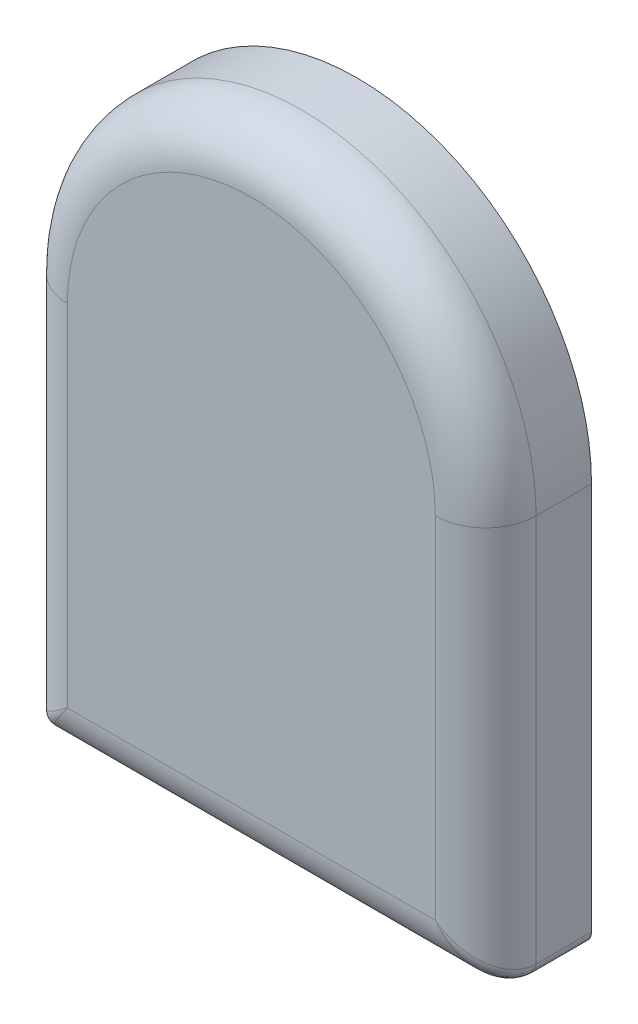
ISO-10303-21;
HEADER;
FILE_DESCRIPTION(('STEP AP214'),'2;1');
FILE_NAME('part.step','',(''),(''),'','','');
FILE_SCHEMA(('AUTOMOTIVE_DESIGN { 1 0 10303 214 1 1 1 1 }'));
ENDSEC;
DATA;
#1=APPLICATION_CONTEXT('core data for automotive mechanical design processes');
#2=APPLICATION_PROTOCOL_DEFINITION('international standard','automotive_design',2000,#1);
#3=PRODUCT_CONTEXT('',#1,'mechanical');
#4=PRODUCT('Part','Part','',(#3));
#5=PRODUCT_RELATED_PRODUCT_CATEGORY('part','',(#4));
#6=PRODUCT_DEFINITION_FORMATION('','',#4);
#7=PRODUCT_DEFINITION_CONTEXT('part definition',#1,'design');
#8=PRODUCT_DEFINITION('design','',#6,#7);
#9=PRODUCT_DEFINITION_SHAPE('','',#8);
#10=(LENGTH_UNIT() NAMED_UNIT(*) SI_UNIT(.MILLI.,.METRE.));
#11=(NAMED_UNIT(*) PLANE_ANGLE_UNIT() SI_UNIT($,.RADIAN.));
#12=(NAMED_UNIT(*) SI_UNIT($,.STERADIAN.) SOLID_ANGLE_UNIT());
#13=UNCERTAINTY_MEASURE_WITH_UNIT(LENGTH_MEASURE(1.E-05),#10,'distance_accuracy_value','');
#14=(GEOMETRIC_REPRESENTATION_CONTEXT(3) GLOBAL_UNCERTAINTY_ASSIGNED_CONTEXT((#13)) GLOBAL_UNIT_ASSIGNED_CONTEXT((#10,
#11,#12)) REPRESENTATION_CONTEXT('',''));
#15=CARTESIAN_POINT('',(0.,0.,0.));
#16=DIRECTION('',(0.,0.,1.));
#17=DIRECTION('',(1.,0.,0.));
#18=AXIS2_PLACEMENT_3D('',#15,#16,#17);
#19=CARTESIAN_POINT('',(8.8,-12.1,4.2));
#20=DIRECTION('',(0.,0.,-1.));
#21=DIRECTION('',(-1.,0.,0.));
#22=AXIS2_PLACEMENT_3D('',#19,#20,#21);
#23=CYLINDRICAL_SURFACE('',#22,0.5);
#24=DIRECTION('',(0.,0.,-1.));
#25=VECTOR('',#24,1.);
#26=CARTESIAN_POINT('',(9.3,-12.1,4.2));
#27=LINE('',#26,#25);
#28=CARTESIAN_POINT('',(9.3,-12.1,2.2));
#29=VERTEX_POINT('',#28);
#30=CARTESIAN_POINT('',(9.3,-12.1,0.));
#31=VERTEX_POINT('',#30);
#32=EDGE_CURVE('E103',#29,#31,#27,.T.);
#33=ORIENTED_EDGE('',*,*,#32,.F.);
#34=CARTESIAN_POINT('',(8.8,-12.1,2.2));
#35=DIRECTION('',(0.,0.,-1.));
#36=DIRECTION('',(-1.,0.,0.));
#37=AXIS2_PLACEMENT_3D('',#34,#35,#36);
#38=CIRCLE('',#37,0.5);
#39=CARTESIAN_POINT('',(8.8,-12.6,2.2));
#40=VERTEX_POINT('',#39);
#41=EDGE_CURVE('E161',#29,#40,#38,.T.);
#42=ORIENTED_EDGE('',*,*,#41,.T.);
#43=DIRECTION('',(0.,0.,-1.));
#44=VECTOR('',#43,1.);
#45=CARTESIAN_POINT('',(8.8,-12.6,4.2));
#46=LINE('',#45,#44);
#47=CARTESIAN_POINT('',(8.8,-12.6,0.));
#48=VERTEX_POINT('',#47);
#49=EDGE_CURVE('E127',#40,#48,#46,.T.);
#50=ORIENTED_EDGE('',*,*,#49,.T.);
#51=CARTESIAN_POINT('',(8.8,-12.1,0.));
#52=DIRECTION('',(0.,0.,1.));
#53=DIRECTION('',(1.,0.,0.));
#54=AXIS2_PLACEMENT_3D('',#51,#52,#53);
#55=CIRCLE('',#54,0.5);
#56=EDGE_CURVE('E121',#48,#31,#55,.T.);
#57=ORIENTED_EDGE('',*,*,#56,.T.);
#58=EDGE_LOOP('',(#33,#42,#50,#57));
#59=FACE_BOUND('',#58,.T.);
#60=ADVANCED_FACE('F38',(#59),#23,.T.);
#61=CARTESIAN_POINT('',(9.3,3.3,4.2));
#62=DIRECTION('',(-1.,0.,0.));
#63=DIRECTION('',(0.,0.,1.));
#64=AXIS2_PLACEMENT_3D('',#61,#62,#63);
#65=PLANE('',#64);
#66=DIRECTION('',(0.,0.,-1.));
#67=VECTOR('',#66,1.);
#68=CARTESIAN_POINT('',(9.3,3.3,4.2));
#69=LINE('',#68,#67);
#70=CARTESIAN_POINT('',(9.3,3.3,2.2));
#71=VERTEX_POINT('',#70);
#72=CARTESIAN_POINT('',(9.3,3.3,0.));
#73=VERTEX_POINT('',#72);
#74=EDGE_CURVE('E115',#71,#73,#69,.T.);
#75=ORIENTED_EDGE('',*,*,#74,.F.);
#76=DIRECTION('',(0.,1.,0.));
#77=VECTOR('',#76,1.);
#78=CARTESIAN_POINT('',(9.3,-12.1,2.2));
#79=LINE('',#78,#77);
#80=EDGE_CURVE('E110',#71,#29,#79,.F.);
#81=ORIENTED_EDGE('',*,*,#80,.T.);
#82=ORIENTED_EDGE('',*,*,#32,.T.);
#83=DIRECTION('',(0.,1.,0.));
#84=VECTOR('',#83,1.);
#85=CARTESIAN_POINT('',(9.3,3.3,0.));
#86=LINE('',#85,#84);
#87=EDGE_CURVE('E107',#31,#73,#86,.T.);
#88=ORIENTED_EDGE('',*,*,#87,.T.);
#89=EDGE_LOOP('',(#75,#81,#82,#88));
#90=FACE_BOUND('',#89,.T.);
#91=ADVANCED_FACE('F106',(#90),#65,.F.);
#92=CARTESIAN_POINT('',(0.,3.3,4.2));
#93=DIRECTION('',(0.,0.,-1.));
#94=DIRECTION('',(-1.,0.,0.));
#95=AXIS2_PLACEMENT_3D('',#92,#93,#94);
#96=CYLINDRICAL_SURFACE('',#95,9.3);
#97=DIRECTION('',(0.,0.,-1.));
#98=VECTOR('',#97,1.);
#99=CARTESIAN_POINT('',(-9.3,3.3,4.2));
#100=LINE('',#99,#98);
#101=CARTESIAN_POINT('',(-9.3,3.3,2.2));
#102=VERTEX_POINT('',#101);
#103=CARTESIAN_POINT('',(-9.3,3.3,0.));
#104=VERTEX_POINT('',#103);
#105=EDGE_CURVE('E147',#102,#104,#100,.T.);
#106=ORIENTED_EDGE('',*,*,#105,.F.);
#107=CARTESIAN_POINT('',(0.,3.3,2.2));
#108=DIRECTION('',(0.,0.,1.));
#109=DIRECTION('',(1.,0.,0.));
#110=AXIS2_PLACEMENT_3D('',#107,#108,#109);
#111=CIRCLE('',#110,9.3);
#112=EDGE_CURVE('E164',#102,#71,#111,.F.);
#113=ORIENTED_EDGE('',*,*,#112,.T.);
#114=ORIENTED_EDGE('',*,*,#74,.T.);
#115=CARTESIAN_POINT('',(0.,3.3,0.));
#116=DIRECTION('',(0.,0.,1.));
#117=DIRECTION('',(1.,0.,0.));
#118=AXIS2_PLACEMENT_3D('',#115,#116,#117);
#119=CIRCLE('',#118,9.3);
#120=EDGE_CURVE('E124',#73,#104,#119,.T.);
#121=ORIENTED_EDGE('',*,*,#120,.T.);
#122=EDGE_LOOP('',(#106,#113,#114,#121));
#123=FACE_BOUND('',#122,.T.);
#124=ADVANCED_FACE('F216',(#123),#96,.T.);
#125=CARTESIAN_POINT('',(-9.3,-12.1,4.2));
#126=DIRECTION('',(1.,0.,0.));
#127=DIRECTION('',(0.,1.,0.));
#128=AXIS2_PLACEMENT_3D('',#125,#126,#127);
#129=PLANE('',#128);
#130=DIRECTION('',(0.,0.,-1.));
#131=VECTOR('',#130,1.);
#132=CARTESIAN_POINT('',(-9.3,-12.1,4.2));
#133=LINE('',#132,#131);
#134=CARTESIAN_POINT('',(-9.3,-12.1,2.2));
#135=VERTEX_POINT('',#134);
#136=CARTESIAN_POINT('',(-9.3,-12.1,0.));
#137=VERTEX_POINT('',#136);
#138=EDGE_CURVE('E145',#135,#137,#133,.T.);
#139=ORIENTED_EDGE('',*,*,#138,.F.);
#140=DIRECTION('',(0.,-1.,0.));
#141=VECTOR('',#140,1.);
#142=CARTESIAN_POINT('',(-9.3,3.3,2.2));
#143=LINE('',#142,#141);
#144=EDGE_CURVE('E47',#135,#102,#143,.F.);
#145=ORIENTED_EDGE('',*,*,#144,.T.);
#146=ORIENTED_EDGE('',*,*,#105,.T.);
#147=DIRECTION('',(0.,-1.,0.));
#148=VECTOR('',#147,1.);
#149=CARTESIAN_POINT('',(-9.3,-12.1,0.));
#150=LINE('',#149,#148);
#151=EDGE_CURVE('E134',#104,#137,#150,.T.);
#152=ORIENTED_EDGE('',*,*,#151,.T.);
#153=EDGE_LOOP('',(#139,#145,#146,#152));
#154=FACE_BOUND('',#153,.T.);
#155=ADVANCED_FACE('F217',(#154),#129,.F.);
#156=CARTESIAN_POINT('',(-8.8,-12.1,4.2));
#157=DIRECTION('',(0.,0.,-1.));
#158=DIRECTION('',(-1.,0.,0.));
#159=AXIS2_PLACEMENT_3D('',#156,#157,#158);
#160=CYLINDRICAL_SURFACE('',#159,0.5);
#161=DIRECTION('',(0.,0.,-1.));
#162=VECTOR('',#161,1.);
#163=CARTESIAN_POINT('',(-8.8,-12.6,4.2));
#164=LINE('',#163,#162);
#165=CARTESIAN_POINT('',(-8.8,-12.6,2.2));
#166=VERTEX_POINT('',#165);
#167=CARTESIAN_POINT('',(-8.8,-12.6,0.));
#168=VERTEX_POINT('',#167);
#169=EDGE_CURVE('E143',#166,#168,#164,.T.);
#170=ORIENTED_EDGE('',*,*,#169,.F.);
#171=CARTESIAN_POINT('',(-8.8,-12.1,2.2));
#172=DIRECTION('',(0.,0.,-1.));
#173=DIRECTION('',(-1.,0.,0.));
#174=AXIS2_PLACEMENT_3D('',#171,#172,#173);
#175=CIRCLE('',#174,0.5);
#176=EDGE_CURVE('E11',#166,#135,#175,.T.);
#177=ORIENTED_EDGE('',*,*,#176,.T.);
#178=ORIENTED_EDGE('',*,*,#138,.T.);
#179=CARTESIAN_POINT('',(-8.8,-12.1,0.));
#180=DIRECTION('',(0.,0.,1.));
#181=DIRECTION('',(1.,0.,0.));
#182=AXIS2_PLACEMENT_3D('',#179,#180,#181);
#183=CIRCLE('',#182,0.5);
#184=EDGE_CURVE('E137',#137,#168,#183,.T.);
#185=ORIENTED_EDGE('',*,*,#184,.T.);
#186=EDGE_LOOP('',(#170,#177,#178,#185));
#187=FACE_BOUND('',#186,.T.);
#188=ADVANCED_FACE('F219',(#187),#160,.T.);
#189=CARTESIAN_POINT('',(8.8,-12.6,4.2));
#190=DIRECTION('',(0.,1.,0.));
#191=DIRECTION('',(0.,0.,1.));
#192=AXIS2_PLACEMENT_3D('',#189,#190,#191);
#193=PLANE('',#192);
#194=ORIENTED_EDGE('',*,*,#49,.F.);
#195=DIRECTION('',(1.,0.,0.));
#196=VECTOR('',#195,1.);
#197=CARTESIAN_POINT('',(-8.8,-12.6,2.2));
#198=LINE('',#197,#196);
#199=EDGE_CURVE('E158',#40,#166,#198,.F.);
#200=ORIENTED_EDGE('',*,*,#199,.T.);
#201=ORIENTED_EDGE('',*,*,#169,.T.);
#202=DIRECTION('',(1.,0.,0.));
#203=VECTOR('',#202,1.);
#204=CARTESIAN_POINT('',(8.8,-12.6,0.));
#205=LINE('',#204,#203);
#206=EDGE_CURVE('E140',#168,#48,#205,.T.);
#207=ORIENTED_EDGE('',*,*,#206,.T.);
#208=EDGE_LOOP('',(#194,#200,#201,#207));
#209=FACE_BOUND('',#208,.T.);
#210=ADVANCED_FACE('F221',(#209),#193,.F.);
#211=CARTESIAN_POINT('',(8.8,-12.1,4.2));
#212=DIRECTION('',(0.,0.,1.));
#213=DIRECTION('',(1.,0.,0.));
#214=AXIS2_PLACEMENT_3D('',#211,#212,#213);
#215=PLANE('',#214);
#216=DIRECTION('',(0.,-1.,0.));
#217=VECTOR('',#216,1.);
#218=CARTESIAN_POINT('',(-7.3,-12.1,4.2));
#219=LINE('',#218,#217);
#220=CARTESIAN_POINT('',(-7.3,3.3,4.2));
#221=VERTEX_POINT('',#220);
#222=CARTESIAN_POINT('',(-7.3,-10.6,4.2));
#223=VERTEX_POINT('',#222);
#224=EDGE_CURVE('E114',#221,#223,#219,.T.);
#225=ORIENTED_EDGE('',*,*,#224,.T.);
#226=DIRECTION('',(1.,0.,0.));
#227=VECTOR('',#226,1.);
#228=CARTESIAN_POINT('',(8.8,-10.6,4.2));
#229=LINE('',#228,#227);
#230=CARTESIAN_POINT('',(7.3,-10.6,4.2));
#231=VERTEX_POINT('',#230);
#232=EDGE_CURVE('E155',#223,#231,#229,.T.);
#233=ORIENTED_EDGE('',*,*,#232,.T.);
#234=DIRECTION('',(0.,1.,0.));
#235=VECTOR('',#234,1.);
#236=CARTESIAN_POINT('',(7.3,3.3,4.2));
#237=LINE('',#236,#235);
#238=CARTESIAN_POINT('',(7.3,3.3,4.2));
#239=VERTEX_POINT('',#238);
#240=EDGE_CURVE('E153',#231,#239,#237,.T.);
#241=ORIENTED_EDGE('',*,*,#240,.T.);
#242=CARTESIAN_POINT('',(0.,3.3,4.2));
#243=DIRECTION('',(0.,0.,1.));
#244=DIRECTION('',(1.,0.,0.));
#245=AXIS2_PLACEMENT_3D('',#242,#243,#244);
#246=CIRCLE('',#245,7.3);
#247=EDGE_CURVE('E151',#239,#221,#246,.T.);
#248=ORIENTED_EDGE('',*,*,#247,.T.);
#249=EDGE_LOOP('',(#225,#233,#241,#248));
#250=FACE_BOUND('',#249,.T.);
#251=ADVANCED_FACE('F227',(#250),#215,.T.);
#252=CARTESIAN_POINT('',(8.8,-12.1,0.));
#253=DIRECTION('',(0.,0.,1.));
#254=DIRECTION('',(1.,0.,0.));
#255=AXIS2_PLACEMENT_3D('',#252,#253,#254);
#256=PLANE('',#255);
#257=ORIENTED_EDGE('',*,*,#56,.F.);
#258=ORIENTED_EDGE('',*,*,#206,.F.);
#259=ORIENTED_EDGE('',*,*,#184,.F.);
#260=ORIENTED_EDGE('',*,*,#151,.F.);
#261=ORIENTED_EDGE('',*,*,#120,.F.);
#262=ORIENTED_EDGE('',*,*,#87,.F.);
#263=EDGE_LOOP('',(#257,#258,#259,#260,#261,#262));
#264=FACE_BOUND('',#263,.T.);
#265=ADVANCED_FACE('F119',(#264),#256,.F.);
#266=CARTESIAN_POINT('',(0.,3.3,2.2));
#267=DIRECTION('',(0.,0.,1.));
#268=DIRECTION('',(1.,0.,0.));
#269=AXIS2_PLACEMENT_3D('',#266,#267,#268);
#270=TOROIDAL_SURFACE('',#269,7.3,2.);
#271=CARTESIAN_POINT('',(7.3,3.3,2.2));
#272=DIRECTION('',(0.,-1.,0.));
#273=DIRECTION('',(0.,0.,-1.));
#274=AXIS2_PLACEMENT_3D('',#271,#272,#273);
#275=CIRCLE('',#274,2.);
#276=EDGE_CURVE('E131',#71,#239,#275,.T.);
#277=ORIENTED_EDGE('',*,*,#276,.F.);
#278=ORIENTED_EDGE('',*,*,#112,.F.);
#279=CARTESIAN_POINT('',(-7.3,3.3,2.2));
#280=DIRECTION('',(0.,-1.,0.));
#281=DIRECTION('',(1.,0.,0.));
#282=AXIS2_PLACEMENT_3D('',#279,#280,#281);
#283=CIRCLE('',#282,2.);
#284=EDGE_CURVE('E42',#221,#102,#283,.T.);
#285=ORIENTED_EDGE('',*,*,#284,.F.);
#286=ORIENTED_EDGE('',*,*,#247,.F.);
#287=EDGE_LOOP('',(#277,#278,#285,#286));
#288=FACE_BOUND('',#287,.T.);
#289=ADVANCED_FACE('F40',(#288),#270,.T.);
#290=CARTESIAN_POINT('',(-7.3,-12.1,2.2));
#291=DIRECTION('',(0.,1.,0.));
#292=DIRECTION('',(-1.,0.,0.));
#293=AXIS2_PLACEMENT_3D('',#290,#291,#292);
#294=CYLINDRICAL_SURFACE('',#293,2.);
#295=ORIENTED_EDGE('',*,*,#284,.T.);
#296=ORIENTED_EDGE('',*,*,#144,.F.);
#297=CARTESIAN_POINT('',(-7.3,-10.6,2.2));
#298=DIRECTION('',(0.6,-0.8,0.));
#299=DIRECTION('',(-0.8,-0.6,0.));
#300=AXIS2_PLACEMENT_3D('',#297,#298,#299);
#301=ELLIPSE('',#300,2.5,2.);
#302=EDGE_CURVE('E174',#223,#135,#301,.T.);
#303=ORIENTED_EDGE('',*,*,#302,.F.);
#304=ORIENTED_EDGE('',*,*,#224,.F.);
#305=EDGE_LOOP('',(#295,#296,#303,#304));
#306=FACE_BOUND('',#305,.T.);
#307=ADVANCED_FACE('F194',(#306),#294,.T.);
#308=CARTESIAN_POINT('',(7.3,-12.1,2.2));
#309=DIRECTION('',(0.,-1.,0.));
#310=DIRECTION('',(0.,0.,-1.));
#311=AXIS2_PLACEMENT_3D('',#308,#309,#310);
#312=CYLINDRICAL_SURFACE('',#311,2.);
#313=ORIENTED_EDGE('',*,*,#276,.T.);
#314=ORIENTED_EDGE('',*,*,#240,.F.);
#315=CARTESIAN_POINT('',(7.3,-10.6,2.2));
#316=DIRECTION('',(0.6,0.8,0.));
#317=DIRECTION('',(0.8,-0.6,0.));
#318=AXIS2_PLACEMENT_3D('',#315,#316,#317);
#319=ELLIPSE('',#318,2.5,2.);
#320=EDGE_CURVE('E171',#29,#231,#319,.F.);
#321=ORIENTED_EDGE('',*,*,#320,.F.);
#322=ORIENTED_EDGE('',*,*,#80,.F.);
#323=EDGE_LOOP('',(#313,#314,#321,#322));
#324=FACE_BOUND('',#323,.T.);
#325=ADVANCED_FACE('F190',(#324),#312,.T.);
#326=CARTESIAN_POINT('',(-7.3,-10.6,0.200000000000001));
#327=CARTESIAN_POINT('',(-7.3,-10.6,0.200000000000001));
#328=CARTESIAN_POINT('',(-7.3,-10.6,0.200000000000001));
#329=CARTESIAN_POINT('',(-7.36534712065569,-10.6871294942076,0.200035055250015));
#330=CARTESIAN_POINT('',(-7.37625301968526,-10.6762530196853,0.199976339095898));
#331=CARTESIAN_POINT('',(-7.38712949420759,-10.6653471206557,0.200035055250015));
#332=CARTESIAN_POINT('',(-7.43071092668624,-10.7742812355817,0.205696487430835));
#333=CARTESIAN_POINT('',(-7.45271669848803,-10.752716698488,0.204277360821934));
#334=CARTESIAN_POINT('',(-7.47428123558166,-10.7307109266862,0.205696487430835));
#335=CARTESIAN_POINT('',(-7.56031449090428,-10.9470859878724,0.228427051088899));
#336=CARTESIAN_POINT('',(-7.60446975212246,-10.9044697521225,0.22140059823371));
#337=CARTESIAN_POINT('',(-7.64708598787237,-10.8603144909043,0.228427051088899));
#338=CARTESIAN_POINT('',(-7.62455908096206,-11.0327454412827,0.245398809321809));
#339=CARTESIAN_POINT('',(-7.68019165762918,-10.9801916576292,0.234247025705178));
#340=CARTESIAN_POINT('',(-7.73274544128274,-10.9245590809621,0.245398809321809));
#341=CARTESIAN_POINT('',(-7.75083012894728,-11.2011068385964,0.290516308556291));
#342=CARTESIAN_POINT('',(-7.82973753195478,-11.1297375319548,0.268479521630331));
#343=CARTESIAN_POINT('',(-7.90110683859638,-11.0508301289473,0.290516308556291));
#344=CARTESIAN_POINT('',(-7.81287571744484,-11.2838342899265,0.318469854155509));
#345=CARTESIAN_POINT('',(-7.90398851452828,-11.2039885145283,0.289912895749702));
#346=CARTESIAN_POINT('',(-7.98383428992645,-11.1128757174448,0.318469854155509));
#347=CARTESIAN_POINT('',(-7.93366820048003,-11.4448909339734,0.385180085693134));
#348=CARTESIAN_POINT('',(-8.04991425185414,-11.3499142518541,0.341360606992456));
#349=CARTESIAN_POINT('',(-8.14489093397337,-11.23366820048,0.385180085693134));
#350=CARTESIAN_POINT('',(-7.99245870376998,-11.5232782716933,0.423653679114348));
#351=CARTESIAN_POINT('',(-8.12200143121126,-11.4220014312113,0.371441966476322));
#352=CARTESIAN_POINT('',(-8.22327827169331,-11.29245870377,0.423653679114348));
#353=CARTESIAN_POINT('',(-8.10570975300993,-11.6742796706799,0.510834776663723));
#354=CARTESIAN_POINT('',(-8.26295325731846,-11.5629532573185,0.440367062406523));
#355=CARTESIAN_POINT('',(-8.3742796706799,-11.4057097530099,0.510834776663724));
#356=CARTESIAN_POINT('',(-8.1602485580067,-11.7469980773423,0.559177555106217));
#357=CARTESIAN_POINT('',(-8.33220337416109,-11.6322033741611,0.479288917524901));
#358=CARTESIAN_POINT('',(-8.44699807734226,-11.4602485580067,0.559177555106218));
#359=CARTESIAN_POINT('',(-8.26402611496821,-11.8853681532909,0.665353034789945));
#360=CARTESIAN_POINT('',(-8.46682192510474,-11.7668219251047,0.566297856684954));
#361=CARTESIAN_POINT('',(-8.58536815329094,-11.5640261149682,0.665353034789946));
#362=CARTESIAN_POINT('',(-8.31338750743845,-11.9511833432513,0.722755397155792));
#363=CARTESIAN_POINT('',(-8.53252990498461,-11.8325299049846,0.614455680376174));
#364=CARTESIAN_POINT('',(-8.65118334325127,-11.6133875074385,0.722755397155792));
#365=CARTESIAN_POINT('',(-8.40591892041319,-12.0745585605509,0.846132222162794));
#366=CARTESIAN_POINT('',(-8.65927843911775,-11.9592784391177,0.72064706325371));
#367=CARTESIAN_POINT('',(-8.77455856055092,-11.7059189204132,0.846132222162793));
#368=CARTESIAN_POINT('',(-8.44926311849199,-12.132350824656,0.911637313282867));
#369=CARTESIAN_POINT('',(-8.72058796060971,-12.0205879606097,0.77870927589382));
#370=CARTESIAN_POINT('',(-8.83235082465598,-11.749263118492,0.911637313282867));
#371=CARTESIAN_POINT('',(-8.52896450999682,-12.2386193466624,1.05013285836796));
#372=CARTESIAN_POINT('',(-8.83742230607737,-12.1374223060774,0.905718655842486));
#373=CARTESIAN_POINT('',(-8.93861934666242,-11.8289645099968,1.05013285836796));
#374=CARTESIAN_POINT('',(-8.56554818620167,-12.2873975816022,1.12265451812362));
#375=CARTESIAN_POINT('',(-8.893119014594,-12.193119014594,0.974594782404193));
#376=CARTESIAN_POINT('',(-8.98739758160222,-11.8655481862017,1.12265451812362));
#377=CARTESIAN_POINT('',(-8.63104897214961,-12.3747319628661,1.27392958631864));
#378=CARTESIAN_POINT('',(-8.99700237456934,-12.2970023745693,1.12428825163707));
#379=CARTESIAN_POINT('',(-9.07473196286614,-11.9310489721496,1.27392958631864));
#380=CARTESIAN_POINT('',(-8.66023331373321,-12.4136444183109,1.35226632370846));
#381=CARTESIAN_POINT('',(-9.04524564728287,-12.3452456472829,1.20485256451251));
#382=CARTESIAN_POINT('',(-9.11364441831094,-11.9602333137332,1.35226632370846));
#383=CARTESIAN_POINT('',(-8.71039789563343,-12.4805305275112,1.51375694675793));
#384=CARTESIAN_POINT('',(-9.13168487740083,-12.4316848774008,1.37835057694996));
#385=CARTESIAN_POINT('',(-9.18053052751125,-12.0103978956334,1.51375694675793));
#386=CARTESIAN_POINT('',(-8.73165591145982,-12.5088745486131,1.59659973042092));
#387=CARTESIAN_POINT('',(-9.16982930810949,-12.4698293081095,1.47075659896622));
#388=CARTESIAN_POINT('',(-9.20887454861309,-12.0316559114598,1.59659973042092));
#389=CARTESIAN_POINT('',(-8.76560412617006,-12.5541388348934,1.76554895244281));
#390=CARTESIAN_POINT('',(-9.23291592445389,-12.5329159244539,1.6666663568643));
#391=CARTESIAN_POINT('',(-9.25413883489341,-12.0656041261701,1.76554895244281));
#392=CARTESIAN_POINT('',(-8.7785324204649,-12.5713765606199,1.85148270452044));
#393=CARTESIAN_POINT('',(-9.25774658379329,-12.5577465837933,1.76930869505542));
#394=CARTESIAN_POINT('',(-9.27137656061987,-12.0785324204649,1.85148270452044));
#395=CARTESIAN_POINT('',(-8.79566049473916,-12.5942139929855,2.0249775244552));
#396=CARTESIAN_POINT('',(-9.29133353940984,-12.5913335394098,1.98185786072974));
#397=CARTESIAN_POINT('',(-9.29421399298555,-12.0956604947392,2.0249775244552));
#398=CARTESIAN_POINT('',(-8.8,-12.6,2.1124887622276));
#399=CARTESIAN_POINT('',(-9.3,-12.6,2.0906106505444));
#400=CARTESIAN_POINT('',(-9.3,-12.1,2.1124887622276));
#401=CARTESIAN_POINT('',(-8.8,-12.6,2.2875112377724));
#402=CARTESIAN_POINT('',(-9.3,-12.6,2.30938934945561));
#403=CARTESIAN_POINT('',(-9.3,-12.1,2.2875112377724));
#404=CARTESIAN_POINT('',(-8.79566049473916,-12.5942139929855,2.37502247554481));
#405=CARTESIAN_POINT('',(-9.29133353940984,-12.5913335394098,2.41814213927026));
#406=CARTESIAN_POINT('',(-9.29421399298555,-12.0956604947392,2.37502247554481));
#407=CARTESIAN_POINT('',(-8.7785324204649,-12.5713765606199,2.54851729547956));
#408=CARTESIAN_POINT('',(-9.25774658379329,-12.5577465837933,2.63069130494458));
#409=CARTESIAN_POINT('',(-9.27137656061987,-12.0785324204649,2.54851729547956));
#410=CARTESIAN_POINT('',(-8.76560412617006,-12.5541388348934,2.63445104755719));
#411=CARTESIAN_POINT('',(-9.23291592445389,-12.5329159244539,2.7333336431357));
#412=CARTESIAN_POINT('',(-9.25413883489341,-12.0656041261701,2.63445104755719));
#413=CARTESIAN_POINT('',(-8.73165591145982,-12.5088745486131,2.80340026957908));
#414=CARTESIAN_POINT('',(-9.16982930810949,-12.4698293081095,2.92924340103378));
#415=CARTESIAN_POINT('',(-9.20887454861309,-12.0316559114598,2.80340026957908));
#416=CARTESIAN_POINT('',(-8.71039789563343,-12.4805305275113,2.88624305324207));
#417=CARTESIAN_POINT('',(-9.13168487740083,-12.4316848774008,3.02164942305004));
#418=CARTESIAN_POINT('',(-9.18053052751125,-12.0103978956334,2.88624305324207));
#419=CARTESIAN_POINT('',(-8.66023331373321,-12.4136444183109,3.04773367629154));
#420=CARTESIAN_POINT('',(-9.04524564728287,-12.3452456472829,3.19514743548749));
#421=CARTESIAN_POINT('',(-9.11364441831094,-11.9602333137332,3.04773367629154));
#422=CARTESIAN_POINT('',(-8.63104897214961,-12.3747319628661,3.12607041368136));
#423=CARTESIAN_POINT('',(-8.99700237456934,-12.2970023745693,3.27571174836293));
#424=CARTESIAN_POINT('',(-9.07473196286614,-11.9310489721496,3.12607041368136));
#425=CARTESIAN_POINT('',(-8.56554818620167,-12.2873975816022,3.27734548187638));
#426=CARTESIAN_POINT('',(-8.893119014594,-12.193119014594,3.42540521759581));
#427=CARTESIAN_POINT('',(-8.98739758160222,-11.8655481862017,3.27734548187638));
#428=CARTESIAN_POINT('',(-8.52896450999682,-12.2386193466624,3.34986714163205));
#429=CARTESIAN_POINT('',(-8.83742230607737,-12.1374223060774,3.49428134415751));
#430=CARTESIAN_POINT('',(-8.93861934666242,-11.8289645099968,3.34986714163205));
#431=CARTESIAN_POINT('',(-8.44926311849199,-12.132350824656,3.48836268671713));
#432=CARTESIAN_POINT('',(-8.72058796060971,-12.0205879606097,3.62129072410618));
#433=CARTESIAN_POINT('',(-8.83235082465598,-11.749263118492,3.48836268671713));
#434=CARTESIAN_POINT('',(-8.40591892041319,-12.0745585605509,3.55386777783721));
#435=CARTESIAN_POINT('',(-8.65927843911775,-11.9592784391177,3.67935293674629));
#436=CARTESIAN_POINT('',(-8.77455856055092,-11.7059189204132,3.55386777783721));
#437=CARTESIAN_POINT('',(-8.31338750743845,-11.9511833432513,3.67724460284421));
#438=CARTESIAN_POINT('',(-8.53252990498461,-11.8325299049846,3.78554431962383));
#439=CARTESIAN_POINT('',(-8.65118334325127,-11.6133875074385,3.67724460284421));
#440=CARTESIAN_POINT('',(-8.26402611496821,-11.8853681532909,3.73464696521006));
#441=CARTESIAN_POINT('',(-8.46682192510474,-11.7668219251047,3.83370214331505));
#442=CARTESIAN_POINT('',(-8.58536815329094,-11.5640261149682,3.73464696521006));
#443=CARTESIAN_POINT('',(-8.1602485580067,-11.7469980773423,3.84082244489378));
#444=CARTESIAN_POINT('',(-8.33220337416109,-11.6322033741611,3.9207110824751));
#445=CARTESIAN_POINT('',(-8.44699807734226,-11.4602485580067,3.84082244489378));
#446=CARTESIAN_POINT('',(-8.10570975300993,-11.6742796706799,3.88916522333628));
#447=CARTESIAN_POINT('',(-8.26295325731846,-11.5629532573185,3.95963293759348));
#448=CARTESIAN_POINT('',(-8.3742796706799,-11.4057097530099,3.88916522333628));
#449=CARTESIAN_POINT('',(-7.99245870376998,-11.5232782716933,3.97634632088565));
#450=CARTESIAN_POINT('',(-8.12200143121126,-11.4220014312113,4.02855803352368));
#451=CARTESIAN_POINT('',(-8.22327827169331,-11.29245870377,3.97634632088565));
#452=CARTESIAN_POINT('',(-7.93366820048003,-11.4448909339734,4.01481991430687));
#453=CARTESIAN_POINT('',(-8.04991425185414,-11.3499142518541,4.05863939300755));
#454=CARTESIAN_POINT('',(-8.14489093397337,-11.23366820048,4.01481991430687));
#455=CARTESIAN_POINT('',(-7.81287571744484,-11.2838342899265,4.08153014584449));
#456=CARTESIAN_POINT('',(-7.90398851452829,-11.2039885145283,4.1100871042503));
#457=CARTESIAN_POINT('',(-7.98383428992646,-11.1128757174448,4.08153014584449));
#458=CARTESIAN_POINT('',(-7.75083012894728,-11.2011068385964,4.10948369144371));
#459=CARTESIAN_POINT('',(-7.82973753195478,-11.1297375319548,4.13152047836967));
#460=CARTESIAN_POINT('',(-7.90110683859638,-11.0508301289473,4.10948369144371));
#461=CARTESIAN_POINT('',(-7.62455908096206,-11.0327454412827,4.15460119067819));
#462=CARTESIAN_POINT('',(-7.68019165762918,-10.9801916576292,4.16575297429482));
#463=CARTESIAN_POINT('',(-7.73274544128274,-10.9245590809621,4.15460119067819));
#464=CARTESIAN_POINT('',(-7.56031449090428,-10.9470859878724,4.1715729489111));
#465=CARTESIAN_POINT('',(-7.60446975212246,-10.9044697521225,4.17859940176629));
#466=CARTESIAN_POINT('',(-7.64708598787237,-10.8603144909043,4.1715729489111));
#467=CARTESIAN_POINT('',(-7.43071092668624,-10.7742812355817,4.19430351256917));
#468=CARTESIAN_POINT('',(-7.45271669848803,-10.752716698488,4.19572263917807));
#469=CARTESIAN_POINT('',(-7.47428123558166,-10.7307109266862,4.19430351256917));
#470=CARTESIAN_POINT('',(-7.3653471206557,-10.6871294942076,4.19996494474999));
#471=CARTESIAN_POINT('',(-7.37625301968526,-10.6762530196853,4.2000236609041));
#472=CARTESIAN_POINT('',(-7.38712949420759,-10.6653471206557,4.19996494474999));
#473=CARTESIAN_POINT('',(-7.3,-10.6,4.2));
#474=CARTESIAN_POINT('',(-7.3,-10.6,4.2));
#475=CARTESIAN_POINT('',(-7.3,-10.6,4.2));
#476=(BOUNDED_SURFACE() B_SPLINE_SURFACE(3,2,((#326,#327,#328),(#329,#330,#331),(#332,#333,
#334),(#335,#336,#337),(#338,#339,#340),(#341,#342,#343),(#344,#345,#346),(#347,#348,#349),
(#350,#351,#352),(#353,#354,#355),(#356,#357,#358),(#359,#360,#361),(#362,#363,#364),(#365,#366,
#367),(#368,#369,#370),(#371,#372,#373),(#374,#375,#376),(#377,#378,#379),(#380,#381,#382),
(#383,#384,#385),(#386,#387,#388),(#389,#390,#391),(#392,#393,#394),(#395,#396,#397),(#398,#399,
#400),(#401,#402,#403),(#404,#405,#406),(#407,#408,#409),(#410,#411,#412),(#413,#414,#415),
(#416,#417,#418),(#419,#420,#421),(#422,#423,#424),(#425,#426,#427),(#428,#429,#430),(#431,#432,
#433),(#434,#435,#436),(#437,#438,#439),(#440,#441,#442),(#443,#444,#445),(#446,#447,#448),
(#449,#450,#451),(#452,#453,#454),(#455,#456,#457),(#458,#459,#460),(#461,#462,#463),(#464,#465,
#466),(#467,#468,#469),(#470,#471,#472),(#473,#474,#475)),.UNSPECIFIED.,.F.,.F.,
.F.) B_SPLINE_SURFACE_WITH_KNOTS((4,2,2,2,2,2,2,2,2,2,2,2,2,2,2,2,2,2,2,2,2,2,2,2,4),(3,3),(0.,
0.277185081205051,0.552014119053092,0.822233461976019,1.08579611517548,1.34096955189626,
1.58644804888033,1.82146864153553,2.04592551633704,2.26046944958155,2.4665662185127,
2.66647462606246,2.86310321556792,3.05973180507339,3.25964021262314,3.46573698155429,
3.6802809147988,3.90473778960032,4.13975838225551,4.38523687923959,4.64041031596037,
4.90397296915983,5.17419231208275,5.44902134993079,5.72620643113585),(0.,1.),
.UNSPECIFIED.) GEOMETRIC_REPRESENTATION_ITEM() RATIONAL_B_SPLINE_SURFACE(((1.,1.,1.),(1.,
1.00000566557019,1.),(1.,0.998576699090688,1.),(1.,0.992910721279765,1.),(1.,0.988697681267574,
1.),(1.,0.97761712883305,1.),(1.,0.970795325018433,1.),(1.,0.954789124900482,1.),(1.,
0.945667069465631,1.),(1.,0.92548796875733,1.),(1.,0.914501756375306,1.),(1.,0.891169998194024,
1.),(1.,0.878891956959708,1.),(1.,0.853706993048538,1.),(1.,0.84084914596985,1.),(1.,
0.815387454422431,1.),(1.,0.802798170091792,1.),(1.,0.778880732263429,1.),(1.,0.767521437046521,
1.),(1.,0.747118526989836,1.),(1.,0.738001346912332,1.),(1.,0.723039691293395,1.),(1.,
0.717105167896984,1.),(1.,0.709170186451793,1.),(1.,0.707106781186548,1.),(1.,0.707106781186548,
1.),(1.,0.709170186451793,1.),(1.,0.717105167896984,1.),(1.,0.723039691293395,1.),(1.,
0.738001346912332,1.),(1.,0.747118526989835,1.),(1.,0.767521437046521,1.),(1.,0.778880732263429,
1.),(1.,0.802798170091792,1.),(1.,0.815387454422431,1.),(1.,0.84084914596985,1.),(1.,
0.853706993048538,1.),(1.,0.878891956959708,1.),(1.,0.891169998194024,1.),(1.,0.914501756375306,
1.),(1.,0.92548796875733,1.),(1.,0.945667069465631,1.),(1.,0.954789124900482,1.),(1.,
0.970795325018433,1.),(1.,0.97761712883305,1.),(1.,0.988697681267574,1.),(1.,0.992910721279765,
1.),(1.,0.998576699090688,1.),(1.,1.00000566557019,1.),(1.,1.,1.))) REPRESENTATION_ITEM('') SURFACE());
#477=ORIENTED_EDGE('',*,*,#302,.T.);
#478=ORIENTED_EDGE('',*,*,#176,.F.);
#479=CARTESIAN_POINT('',(-7.3,-10.6,2.2));
#480=DIRECTION('',(0.8,-0.6,0.));
#481=DIRECTION('',(-0.6,-0.8,0.));
#482=AXIS2_PLACEMENT_3D('',#479,#480,#481);
#483=ELLIPSE('',#482,2.5,2.);
#484=EDGE_CURVE('E169',#223,#166,#483,.T.);
#485=ORIENTED_EDGE('',*,*,#484,.F.);
#486=EDGE_LOOP('',(#477,#478,#485));
#487=FACE_BOUND('',#486,.T.);
#488=ADVANCED_FACE('F186',(#487),#476,.T.);
#489=CARTESIAN_POINT('',(7.3,-10.6,0.200000000000001));
#490=CARTESIAN_POINT('',(7.3,-10.6,0.200000000000001));
#491=CARTESIAN_POINT('',(7.3,-10.6,0.200000000000001));
#492=CARTESIAN_POINT('',(7.38712949420759,-10.6653471206557,0.200035055250015));
#493=CARTESIAN_POINT('',(7.37625301968526,-10.6762530196853,0.199976339095899));
#494=CARTESIAN_POINT('',(7.3653471206557,-10.6871294942076,0.200035055250015));
#495=CARTESIAN_POINT('',(7.47428123558166,-10.7307109266862,0.205696487430835));
#496=CARTESIAN_POINT('',(7.45271669848803,-10.752716698488,0.204277360821935));
#497=CARTESIAN_POINT('',(7.43071092668625,-10.7742812355817,0.205696487430835));
#498=CARTESIAN_POINT('',(7.64708598787237,-10.8603144909043,0.228427051088899));
#499=CARTESIAN_POINT('',(7.60446975212246,-10.9044697521225,0.22140059823371));
#500=CARTESIAN_POINT('',(7.56031449090428,-10.9470859878724,0.228427051088899));
#501=CARTESIAN_POINT('',(7.73274544128274,-10.9245590809621,0.245398809321809));
#502=CARTESIAN_POINT('',(7.68019165762918,-10.9801916576292,0.234247025705178));
#503=CARTESIAN_POINT('',(7.62455908096206,-11.0327454412827,0.245398809321809));
#504=CARTESIAN_POINT('',(7.90110683859638,-11.0508301289473,0.290516308556291));
#505=CARTESIAN_POINT('',(7.82973753195478,-11.1297375319548,0.268479521630331));
#506=CARTESIAN_POINT('',(7.75083012894728,-11.2011068385964,0.290516308556291));
#507=CARTESIAN_POINT('',(7.98383428992646,-11.1128757174448,0.318469854155509));
#508=CARTESIAN_POINT('',(7.90398851452829,-11.2039885145283,0.289912895749702));
#509=CARTESIAN_POINT('',(7.81287571744484,-11.2838342899265,0.318469854155509));
#510=CARTESIAN_POINT('',(8.14489093397337,-11.23366820048,0.385180085693134));
#511=CARTESIAN_POINT('',(8.04991425185414,-11.3499142518541,0.341360606992456));
#512=CARTESIAN_POINT('',(7.93366820048003,-11.4448909339734,0.385180085693134));
#513=CARTESIAN_POINT('',(8.22327827169331,-11.29245870377,0.423653679114348));
#514=CARTESIAN_POINT('',(8.12200143121127,-11.4220014312113,0.371441966476322));
#515=CARTESIAN_POINT('',(7.99245870376998,-11.5232782716933,0.423653679114348));
#516=CARTESIAN_POINT('',(8.3742796706799,-11.4057097530099,0.510834776663724));
#517=CARTESIAN_POINT('',(8.26295325731846,-11.5629532573185,0.440367062406523));
#518=CARTESIAN_POINT('',(8.10570975300993,-11.6742796706799,0.510834776663724));
#519=CARTESIAN_POINT('',(8.44699807734226,-11.4602485580067,0.559177555106217));
#520=CARTESIAN_POINT('',(8.33220337416109,-11.6322033741611,0.479288917524901));
#521=CARTESIAN_POINT('',(8.1602485580067,-11.7469980773423,0.559177555106217));
#522=CARTESIAN_POINT('',(8.58536815329094,-11.5640261149682,0.665353034789945));
#523=CARTESIAN_POINT('',(8.46682192510474,-11.7668219251047,0.566297856684954));
#524=CARTESIAN_POINT('',(8.26402611496821,-11.8853681532909,0.665353034789945));
#525=CARTESIAN_POINT('',(8.65118334325127,-11.6133875074385,0.722755397155792));
#526=CARTESIAN_POINT('',(8.53252990498461,-11.8325299049846,0.614455680376174));
#527=CARTESIAN_POINT('',(8.31338750743845,-11.9511833432513,0.722755397155792));
#528=CARTESIAN_POINT('',(8.77455856055092,-11.7059189204132,0.846132222162794));
#529=CARTESIAN_POINT('',(8.65927843911775,-11.9592784391178,0.72064706325371));
#530=CARTESIAN_POINT('',(8.40591892041319,-12.0745585605509,0.846132222162794));
#531=CARTESIAN_POINT('',(8.83235082465598,-11.749263118492,0.911637313282867));
#532=CARTESIAN_POINT('',(8.72058796060972,-12.0205879606097,0.77870927589382));
#533=CARTESIAN_POINT('',(8.44926311849199,-12.132350824656,0.911637313282867));
#534=CARTESIAN_POINT('',(8.93861934666242,-11.8289645099968,1.05013285836796));
#535=CARTESIAN_POINT('',(8.83742230607737,-12.1374223060774,0.905718655842486));
#536=CARTESIAN_POINT('',(8.52896450999682,-12.2386193466624,1.05013285836796));
#537=CARTESIAN_POINT('',(8.98739758160223,-11.8655481862017,1.12265451812362));
#538=CARTESIAN_POINT('',(8.893119014594,-12.193119014594,0.974594782404194));
#539=CARTESIAN_POINT('',(8.56554818620167,-12.2873975816022,1.12265451812362));
#540=CARTESIAN_POINT('',(9.07473196286614,-11.9310489721496,1.27392958631864));
#541=CARTESIAN_POINT('',(8.99700237456934,-12.2970023745693,1.12428825163707));
#542=CARTESIAN_POINT('',(8.63104897214961,-12.3747319628661,1.27392958631864));
#543=CARTESIAN_POINT('',(9.11364441831095,-11.9602333137332,1.35226632370846));
#544=CARTESIAN_POINT('',(9.04524564728287,-12.3452456472829,1.20485256451251));
#545=CARTESIAN_POINT('',(8.66023331373321,-12.4136444183109,1.35226632370846));
#546=CARTESIAN_POINT('',(9.18053052751125,-12.0103978956334,1.51375694675793));
#547=CARTESIAN_POINT('',(9.13168487740083,-12.4316848774008,1.37835057694997));
#548=CARTESIAN_POINT('',(8.71039789563344,-12.4805305275112,1.51375694675793));
#549=CARTESIAN_POINT('',(9.2088745486131,-12.0316559114598,1.59659973042092));
#550=CARTESIAN_POINT('',(9.16982930810949,-12.4698293081095,1.47075659896622));
#551=CARTESIAN_POINT('',(8.73165591145982,-12.5088745486131,1.59659973042092));
#552=CARTESIAN_POINT('',(9.25413883489341,-12.0656041261701,1.76554895244281));
#553=CARTESIAN_POINT('',(9.23291592445389,-12.5329159244539,1.6666663568643));
#554=CARTESIAN_POINT('',(8.76560412617006,-12.5541388348934,1.76554895244281));
#555=CARTESIAN_POINT('',(9.27137656061987,-12.0785324204649,1.85148270452044));
#556=CARTESIAN_POINT('',(9.25774658379329,-12.5577465837933,1.76930869505542));
#557=CARTESIAN_POINT('',(8.77853242046491,-12.5713765606199,1.85148270452044));
#558=CARTESIAN_POINT('',(9.29421399298555,-12.0956604947392,2.0249775244552));
#559=CARTESIAN_POINT('',(9.29133353940984,-12.5913335394098,1.98185786072974));
#560=CARTESIAN_POINT('',(8.79566049473916,-12.5942139929855,2.0249775244552));
#561=CARTESIAN_POINT('',(9.3,-12.1,2.1124887622276));
#562=CARTESIAN_POINT('',(9.3,-12.6,2.0906106505444));
#563=CARTESIAN_POINT('',(8.8,-12.6,2.1124887622276));
#564=CARTESIAN_POINT('',(9.3,-12.1,2.2875112377724));
#565=CARTESIAN_POINT('',(9.3,-12.6,2.30938934945561));
#566=CARTESIAN_POINT('',(8.8,-12.6,2.2875112377724));
#567=CARTESIAN_POINT('',(9.29421399298555,-12.0956604947392,2.37502247554481));
#568=CARTESIAN_POINT('',(9.29133353940984,-12.5913335394098,2.41814213927026));
#569=CARTESIAN_POINT('',(8.79566049473916,-12.5942139929855,2.37502247554481));
#570=CARTESIAN_POINT('',(9.27137656061987,-12.0785324204649,2.54851729547956));
#571=CARTESIAN_POINT('',(9.25774658379329,-12.5577465837933,2.63069130494458));
#572=CARTESIAN_POINT('',(8.77853242046491,-12.5713765606199,2.54851729547956));
#573=CARTESIAN_POINT('',(9.25413883489341,-12.0656041261701,2.63445104755719));
#574=CARTESIAN_POINT('',(9.23291592445389,-12.5329159244539,2.7333336431357));
#575=CARTESIAN_POINT('',(8.76560412617006,-12.5541388348934,2.63445104755719));
#576=CARTESIAN_POINT('',(9.2088745486131,-12.0316559114598,2.80340026957908));
#577=CARTESIAN_POINT('',(9.1698293081095,-12.4698293081095,2.92924340103378));
#578=CARTESIAN_POINT('',(8.73165591145982,-12.5088745486131,2.80340026957908));
#579=CARTESIAN_POINT('',(9.18053052751125,-12.0103978956334,2.88624305324207));
#580=CARTESIAN_POINT('',(9.13168487740083,-12.4316848774008,3.02164942305004));
#581=CARTESIAN_POINT('',(8.71039789563344,-12.4805305275113,2.88624305324207));
#582=CARTESIAN_POINT('',(9.11364441831095,-11.9602333137332,3.04773367629154));
#583=CARTESIAN_POINT('',(9.04524564728287,-12.3452456472829,3.19514743548749));
#584=CARTESIAN_POINT('',(8.66023331373321,-12.4136444183109,3.04773367629154));
#585=CARTESIAN_POINT('',(9.07473196286614,-11.9310489721496,3.12607041368136));
#586=CARTESIAN_POINT('',(8.99700237456934,-12.2970023745693,3.27571174836293));
#587=CARTESIAN_POINT('',(8.63104897214961,-12.3747319628661,3.12607041368136));
#588=CARTESIAN_POINT('',(8.98739758160223,-11.8655481862017,3.27734548187638));
#589=CARTESIAN_POINT('',(8.893119014594,-12.193119014594,3.42540521759581));
#590=CARTESIAN_POINT('',(8.56554818620167,-12.2873975816022,3.27734548187638));
#591=CARTESIAN_POINT('',(8.93861934666242,-11.8289645099968,3.34986714163205));
#592=CARTESIAN_POINT('',(8.83742230607736,-12.1374223060774,3.49428134415751));
#593=CARTESIAN_POINT('',(8.52896450999682,-12.2386193466624,3.34986714163205));
#594=CARTESIAN_POINT('',(8.83235082465598,-11.749263118492,3.48836268671713));
#595=CARTESIAN_POINT('',(8.72058796060972,-12.0205879606097,3.62129072410618));
#596=CARTESIAN_POINT('',(8.44926311849199,-12.132350824656,3.48836268671713));
#597=CARTESIAN_POINT('',(8.77455856055092,-11.7059189204132,3.55386777783721));
#598=CARTESIAN_POINT('',(8.65927843911775,-11.9592784391177,3.67935293674629));
#599=CARTESIAN_POINT('',(8.40591892041319,-12.0745585605509,3.55386777783721));
#600=CARTESIAN_POINT('',(8.65118334325127,-11.6133875074385,3.67724460284421));
#601=CARTESIAN_POINT('',(8.53252990498462,-11.8325299049846,3.78554431962383));
#602=CARTESIAN_POINT('',(8.31338750743846,-11.9511833432513,3.67724460284421));
#603=CARTESIAN_POINT('',(8.58536815329094,-11.5640261149682,3.73464696521005));
#604=CARTESIAN_POINT('',(8.46682192510474,-11.7668219251047,3.83370214331505));
#605=CARTESIAN_POINT('',(8.26402611496821,-11.8853681532909,3.73464696521005));
#606=CARTESIAN_POINT('',(8.44699807734226,-11.4602485580067,3.84082244489378));
#607=CARTESIAN_POINT('',(8.33220337416109,-11.6322033741611,3.9207110824751));
#608=CARTESIAN_POINT('',(8.1602485580067,-11.7469980773423,3.84082244489378));
#609=CARTESIAN_POINT('',(8.3742796706799,-11.4057097530099,3.88916522333628));
#610=CARTESIAN_POINT('',(8.26295325731846,-11.5629532573185,3.95963293759348));
#611=CARTESIAN_POINT('',(8.10570975300993,-11.6742796706799,3.88916522333628));
#612=CARTESIAN_POINT('',(8.22327827169332,-11.29245870377,3.97634632088565));
#613=CARTESIAN_POINT('',(8.12200143121127,-11.4220014312113,4.02855803352368));
#614=CARTESIAN_POINT('',(7.99245870376999,-11.5232782716933,3.97634632088565));
#615=CARTESIAN_POINT('',(8.14489093397337,-11.23366820048,4.01481991430687));
#616=CARTESIAN_POINT('',(8.04991425185414,-11.3499142518541,4.05863939300755));
#617=CARTESIAN_POINT('',(7.93366820048003,-11.4448909339734,4.01481991430687));
#618=CARTESIAN_POINT('',(7.98383428992646,-11.1128757174448,4.08153014584449));
#619=CARTESIAN_POINT('',(7.90398851452829,-11.2039885145283,4.1100871042503));
#620=CARTESIAN_POINT('',(7.81287571744484,-11.2838342899265,4.08153014584449));
#621=CARTESIAN_POINT('',(7.90110683859638,-11.0508301289473,4.10948369144371));
#622=CARTESIAN_POINT('',(7.82973753195478,-11.1297375319548,4.13152047836967));
#623=CARTESIAN_POINT('',(7.75083012894729,-11.2011068385964,4.10948369144371));
#624=CARTESIAN_POINT('',(7.73274544128274,-10.9245590809621,4.15460119067819));
#625=CARTESIAN_POINT('',(7.68019165762918,-10.9801916576292,4.16575297429482));
#626=CARTESIAN_POINT('',(7.62455908096206,-11.0327454412827,4.15460119067819));
#627=CARTESIAN_POINT('',(7.64708598787237,-10.8603144909043,4.1715729489111));
#628=CARTESIAN_POINT('',(7.60446975212246,-10.9044697521225,4.17859940176629));
#629=CARTESIAN_POINT('',(7.56031449090428,-10.9470859878724,4.1715729489111));
#630=CARTESIAN_POINT('',(7.47428123558166,-10.7307109266862,4.19430351256917));
#631=CARTESIAN_POINT('',(7.45271669848803,-10.752716698488,4.19572263917807));
#632=CARTESIAN_POINT('',(7.43071092668625,-10.7742812355817,4.19430351256917));
#633=CARTESIAN_POINT('',(7.38712949420759,-10.6653471206557,4.19996494474999));
#634=CARTESIAN_POINT('',(7.37625301968526,-10.6762530196853,4.2000236609041));
#635=CARTESIAN_POINT('',(7.3653471206557,-10.6871294942076,4.19996494474999));
#636=CARTESIAN_POINT('',(7.3,-10.6,4.2));
#637=CARTESIAN_POINT('',(7.3,-10.6,4.2));
#638=CARTESIAN_POINT('',(7.3,-10.6,4.2));
#639=(BOUNDED_SURFACE() B_SPLINE_SURFACE(3,2,((#489,#490,#491),(#492,#493,#494),(#495,#496,
#497),(#498,#499,#500),(#501,#502,#503),(#504,#505,#506),(#507,#508,#509),(#510,#511,#512),
(#513,#514,#515),(#516,#517,#518),(#519,#520,#521),(#522,#523,#524),(#525,#526,#527),(#528,#529,
#530),(#531,#532,#533),(#534,#535,#536),(#537,#538,#539),(#540,#541,#542),(#543,#544,#545),
(#546,#547,#548),(#549,#550,#551),(#552,#553,#554),(#555,#556,#557),(#558,#559,#560),(#561,#562,
#563),(#564,#565,#566),(#567,#568,#569),(#570,#571,#572),(#573,#574,#575),(#576,#577,#578),
(#579,#580,#581),(#582,#583,#584),(#585,#586,#587),(#588,#589,#590),(#591,#592,#593),(#594,#595,
#596),(#597,#598,#599),(#600,#601,#602),(#603,#604,#605),(#606,#607,#608),(#609,#610,#611),
(#612,#613,#614),(#615,#616,#617),(#618,#619,#620),(#621,#622,#623),(#624,#625,#626),(#627,#628,
#629),(#630,#631,#632),(#633,#634,#635),(#636,#637,#638)),.UNSPECIFIED.,.F.,.F.,
.F.) B_SPLINE_SURFACE_WITH_KNOTS((4,2,2,2,2,2,2,2,2,2,2,2,2,2,2,2,2,2,2,2,2,2,2,2,4),(3,3),(0.,
0.277185081205051,0.552014119053092,0.822233461976019,1.08579611517548,1.34096955189625,
1.58644804888033,1.82146864153553,2.04592551633704,2.26046944958155,2.4665662185127,
2.66647462606246,2.86310321556792,3.05973180507339,3.25964021262314,3.46573698155429,
3.6802809147988,3.90473778960032,4.13975838225551,4.38523687923959,4.64041031596037,
4.90397296915982,5.17419231208275,5.44902134993079,5.72620643113585),(0.,1.),
.UNSPECIFIED.) GEOMETRIC_REPRESENTATION_ITEM() RATIONAL_B_SPLINE_SURFACE(((1.,1.,1.),(1.,
1.00000566557019,1.),(1.,0.998576699090688,1.),(1.,0.992910721279765,1.),(1.,0.988697681267574,
1.),(1.,0.97761712883305,1.),(1.,0.970795325018433,1.),(1.,0.954789124900482,1.),(1.,
0.945667069465631,1.),(1.,0.92548796875733,1.),(1.,0.914501756375307,1.),(1.,0.891169998194025,
1.),(1.,0.878891956959708,1.),(1.,0.853706993048538,1.),(1.,0.84084914596985,1.),(1.,
0.815387454422431,1.),(1.,0.802798170091792,1.),(1.,0.778880732263429,1.),(1.,0.767521437046521,
1.),(1.,0.747118526989836,1.),(1.,0.738001346912332,1.),(1.,0.723039691293395,1.),(1.,
0.717105167896984,1.),(1.,0.709170186451793,1.),(1.,0.707106781186548,1.),(1.,0.707106781186548,
1.),(1.,0.709170186451793,1.),(1.,0.717105167896984,1.),(1.,0.723039691293394,1.),(1.,
0.738001346912332,1.),(1.,0.747118526989835,1.),(1.,0.767521437046521,1.),(1.,0.778880732263429,
1.),(1.,0.802798170091792,1.),(1.,0.815387454422431,1.),(1.,0.84084914596985,1.),(1.,
0.853706993048538,1.),(1.,0.878891956959708,1.),(1.,0.891169998194024,1.),(1.,0.914501756375306,
1.),(1.,0.92548796875733,1.),(1.,0.945667069465631,1.),(1.,0.954789124900482,1.),(1.,
0.970795325018433,1.),(1.,0.97761712883305,1.),(1.,0.988697681267574,1.),(1.,0.992910721279765,
1.),(1.,0.998576699090688,1.),(1.,1.00000566557019,1.),(1.,1.,1.))) REPRESENTATION_ITEM('') SURFACE());
#640=ORIENTED_EDGE('',*,*,#41,.F.);
#641=ORIENTED_EDGE('',*,*,#320,.T.);
#642=CARTESIAN_POINT('',(7.3,-10.6,2.2));
#643=DIRECTION('',(0.8,0.6,0.));
#644=DIRECTION('',(0.6,-0.8,0.));
#645=AXIS2_PLACEMENT_3D('',#642,#643,#644);
#646=ELLIPSE('',#645,2.5,2.);
#647=EDGE_CURVE('E167',#40,#231,#646,.F.);
#648=ORIENTED_EDGE('',*,*,#647,.F.);
#649=EDGE_LOOP('',(#640,#641,#648));
#650=FACE_BOUND('',#649,.T.);
#651=ADVANCED_FACE('F179',(#650),#639,.T.);
#652=CARTESIAN_POINT('',(8.8,-10.6,2.2));
#653=DIRECTION('',(-1.,0.,0.));
#654=DIRECTION('',(0.,0.,1.));
#655=AXIS2_PLACEMENT_3D('',#652,#653,#654);
#656=CYLINDRICAL_SURFACE('',#655,2.);
#657=ORIENTED_EDGE('',*,*,#484,.T.);
#658=ORIENTED_EDGE('',*,*,#199,.F.);
#659=ORIENTED_EDGE('',*,*,#647,.T.);
#660=ORIENTED_EDGE('',*,*,#232,.F.);
#661=EDGE_LOOP('',(#657,#658,#659,#660));
#662=FACE_BOUND('',#661,.T.);
#663=ADVANCED_FACE('F185',(#662),#656,.T.);
#664=CLOSED_SHELL('',(#60,#91,#124,#155,#188,#210,#251,#265,#289,#307,#325,#488,#651,#663));
#665=MANIFOLD_SOLID_BREP('B2',#664);
#666=ADVANCED_BREP_SHAPE_REPRESENTATION('',(#18,#665),#14);
#667=SHAPE_DEFINITION_REPRESENTATION(#9,#666);
ENDSEC;
END-ISO-10303-21;
